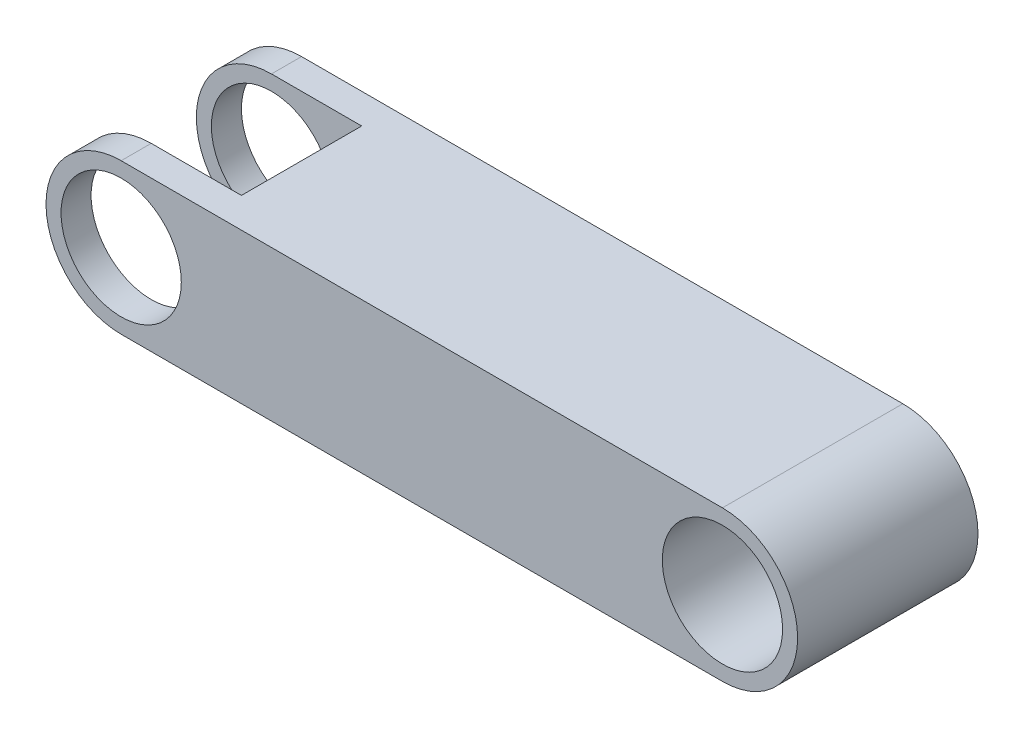
ISO-10303-21;
HEADER;
FILE_DESCRIPTION(('STEP AP214'),'2;1');
FILE_NAME('part.step','',(''),(''),'','','');
FILE_SCHEMA(('AUTOMOTIVE_DESIGN { 1 0 10303 214 1 1 1 1 }'));
ENDSEC;
DATA;
#1=APPLICATION_CONTEXT('core data for automotive mechanical design processes');
#2=APPLICATION_PROTOCOL_DEFINITION('international standard','automotive_design',2000,#1);
#3=PRODUCT_CONTEXT('',#1,'mechanical');
#4=PRODUCT('Part','Part','',(#3));
#5=PRODUCT_RELATED_PRODUCT_CATEGORY('part','',(#4));
#6=PRODUCT_DEFINITION_FORMATION('','',#4);
#7=PRODUCT_DEFINITION_CONTEXT('part definition',#1,'design');
#8=PRODUCT_DEFINITION('design','',#6,#7);
#9=PRODUCT_DEFINITION_SHAPE('','',#8);
#10=(LENGTH_UNIT() NAMED_UNIT(*) SI_UNIT(.MILLI.,.METRE.));
#11=(NAMED_UNIT(*) PLANE_ANGLE_UNIT() SI_UNIT($,.RADIAN.));
#12=(NAMED_UNIT(*) SI_UNIT($,.STERADIAN.) SOLID_ANGLE_UNIT());
#13=UNCERTAINTY_MEASURE_WITH_UNIT(LENGTH_MEASURE(1.E-05),#10,'distance_accuracy_value','');
#14=(GEOMETRIC_REPRESENTATION_CONTEXT(3) GLOBAL_UNCERTAINTY_ASSIGNED_CONTEXT((#13)) GLOBAL_UNIT_ASSIGNED_CONTEXT((#10,
#11,#12)) REPRESENTATION_CONTEXT('',''));
#15=CARTESIAN_POINT('',(0.,0.,0.));
#16=DIRECTION('',(0.,0.,1.));
#17=DIRECTION('',(1.,0.,0.));
#18=AXIS2_PLACEMENT_3D('',#15,#16,#17);
#19=CARTESIAN_POINT('',(0.,0.,15.));
#20=DIRECTION('',(0.,0.,-1.));
#21=DIRECTION('',(-1.,0.,0.));
#22=AXIS2_PLACEMENT_3D('',#19,#20,#21);
#23=CYLINDRICAL_SURFACE('',#22,12.5);
#24=DIRECTION('',(0.,0.,-1.));
#25=VECTOR('',#24,1.);
#26=CARTESIAN_POINT('',(0.,-12.5,15.));
#27=LINE('',#26,#25);
#28=CARTESIAN_POINT('',(0.,-12.5,-10.));
#29=VERTEX_POINT('',#28);
#30=CARTESIAN_POINT('',(0.,-12.5,-15.));
#31=VERTEX_POINT('',#30);
#32=EDGE_CURVE('E55',#29,#31,#27,.T.);
#33=ORIENTED_EDGE('',*,*,#32,.F.);
#34=CARTESIAN_POINT('',(0.,0.,-10.));
#35=DIRECTION('',(0.,0.,-1.));
#36=DIRECTION('',(-1.,0.,0.));
#37=AXIS2_PLACEMENT_3D('',#34,#35,#36);
#38=CIRCLE('',#37,12.5);
#39=CARTESIAN_POINT('',(0.,12.5,-10.));
#40=VERTEX_POINT('',#39);
#41=EDGE_CURVE('E156',#29,#40,#38,.T.);
#42=ORIENTED_EDGE('',*,*,#41,.T.);
#43=DIRECTION('',(0.,0.,-1.));
#44=VECTOR('',#43,1.);
#45=CARTESIAN_POINT('',(0.,12.5,15.));
#46=LINE('',#45,#44);
#47=CARTESIAN_POINT('',(0.,12.5,-15.));
#48=VERTEX_POINT('',#47);
#49=EDGE_CURVE('E94',#40,#48,#46,.T.);
#50=ORIENTED_EDGE('',*,*,#49,.T.);
#51=CARTESIAN_POINT('',(0.,0.,-15.));
#52=DIRECTION('',(0.,0.,1.));
#53=DIRECTION('',(1.,0.,0.));
#54=AXIS2_PLACEMENT_3D('',#51,#52,#53);
#55=CIRCLE('',#54,12.5);
#56=EDGE_CURVE('E172',#48,#31,#55,.T.);
#57=ORIENTED_EDGE('',*,*,#56,.T.);
#58=EDGE_LOOP('',(#33,#42,#50,#57));
#59=FACE_BOUND('',#58,.T.);
#60=ADVANCED_FACE('F45',(#59),#23,.T.);
#61=CARTESIAN_POINT('',(0.,0.,15.));
#62=DIRECTION('',(0.,0.,-1.));
#63=DIRECTION('',(-1.,0.,0.));
#64=AXIS2_PLACEMENT_3D('',#61,#62,#63);
#65=CYLINDRICAL_SURFACE('',#64,9.99999999999999);
#66=CARTESIAN_POINT('',(0.,0.,-10.));
#67=DIRECTION('',(0.,0.,-1.));
#68=DIRECTION('',(-1.,0.,0.));
#69=AXIS2_PLACEMENT_3D('',#66,#67,#68);
#70=CIRCLE('',#69,9.99999999999999);
#71=CARTESIAN_POINT('',(-9.99999999999999,0.,-10.));
#72=VERTEX_POINT('',#71);
#73=EDGE_CURVE('E49',#72,#72,#70,.T.);
#74=ORIENTED_EDGE('',*,*,#73,.F.);
#75=EDGE_LOOP('',(#74));
#76=FACE_BOUND('',#75,.T.);
#77=CARTESIAN_POINT('',(0.,0.,-15.));
#78=DIRECTION('',(0.,0.,1.));
#79=DIRECTION('',(1.,0.,0.));
#80=AXIS2_PLACEMENT_3D('',#77,#78,#79);
#81=CIRCLE('',#80,9.99999999999999);
#82=CARTESIAN_POINT('',(9.99999999999999,0.,-15.));
#83=VERTEX_POINT('',#82);
#84=EDGE_CURVE('E164',#83,#83,#81,.T.);
#85=ORIENTED_EDGE('',*,*,#84,.F.);
#86=EDGE_LOOP('',(#85));
#87=FACE_BOUND('',#86,.T.);
#88=ADVANCED_FACE('F242',(#76,#87),#65,.F.);
#89=CARTESIAN_POINT('',(0.,0.,15.));
#90=DIRECTION('',(0.,0.,1.));
#91=DIRECTION('',(1.,0.,0.));
#92=AXIS2_PLACEMENT_3D('',#89,#90,#91);
#93=PLANE('',#92);
#94=CARTESIAN_POINT('',(0.,0.,15.));
#95=DIRECTION('',(0.,0.,1.));
#96=DIRECTION('',(1.,0.,0.));
#97=AXIS2_PLACEMENT_3D('',#94,#95,#96);
#98=CIRCLE('',#97,9.99999999999999);
#99=CARTESIAN_POINT('',(9.99999999999999,0.,15.));
#100=VERTEX_POINT('',#99);
#101=EDGE_CURVE('E168',#100,#100,#98,.T.);
#102=ORIENTED_EDGE('',*,*,#101,.F.);
#103=EDGE_LOOP('',(#102));
#104=FACE_BOUND('',#103,.T.);
#105=CARTESIAN_POINT('',(0.,0.,15.));
#106=DIRECTION('',(0.,0.,1.));
#107=DIRECTION('',(1.,0.,0.));
#108=AXIS2_PLACEMENT_3D('',#105,#106,#107);
#109=CIRCLE('',#108,12.5);
#110=CARTESIAN_POINT('',(0.,12.5,15.));
#111=VERTEX_POINT('',#110);
#112=CARTESIAN_POINT('',(0.,-12.5,15.));
#113=VERTEX_POINT('',#112);
#114=EDGE_CURVE('E176',#111,#113,#109,.T.);
#115=ORIENTED_EDGE('',*,*,#114,.T.);
#116=DIRECTION('',(1.,0.,0.));
#117=VECTOR('',#116,1.);
#118=CARTESIAN_POINT('',(0.,-12.5,15.));
#119=LINE('',#118,#117);
#120=CARTESIAN_POINT('',(100.,-12.5,15.));
#121=VERTEX_POINT('',#120);
#122=EDGE_CURVE('E101',#113,#121,#119,.T.);
#123=ORIENTED_EDGE('',*,*,#122,.T.);
#124=CARTESIAN_POINT('',(100.,0.,15.));
#125=DIRECTION('',(0.,0.,1.));
#126=DIRECTION('',(1.,0.,0.));
#127=AXIS2_PLACEMENT_3D('',#124,#125,#126);
#128=CIRCLE('',#127,12.5);
#129=CARTESIAN_POINT('',(100.,12.5,15.));
#130=VERTEX_POINT('',#129);
#131=EDGE_CURVE('E182',#121,#130,#128,.T.);
#132=ORIENTED_EDGE('',*,*,#131,.T.);
#133=DIRECTION('',(-1.,0.,0.));
#134=VECTOR('',#133,1.);
#135=CARTESIAN_POINT('',(0.,12.5,15.));
#136=LINE('',#135,#134);
#137=EDGE_CURVE('E72',#130,#111,#136,.T.);
#138=ORIENTED_EDGE('',*,*,#137,.T.);
#139=EDGE_LOOP('',(#115,#123,#132,#138));
#140=FACE_BOUND('',#139,.T.);
#141=CARTESIAN_POINT('',(100.,0.,15.));
#142=DIRECTION('',(0.,0.,1.));
#143=DIRECTION('',(1.,0.,0.));
#144=AXIS2_PLACEMENT_3D('',#141,#142,#143);
#145=CIRCLE('',#144,9.99999999999999);
#146=CARTESIAN_POINT('',(110.,0.,15.));
#147=VERTEX_POINT('',#146);
#148=EDGE_CURVE('E160',#147,#147,#145,.T.);
#149=ORIENTED_EDGE('',*,*,#148,.F.);
#150=EDGE_LOOP('',(#149));
#151=FACE_BOUND('',#150,.T.);
#152=ADVANCED_FACE('F245',(#104,#140,#151),#93,.T.);
#153=CARTESIAN_POINT('',(0.,0.,-15.));
#154=DIRECTION('',(0.,0.,1.));
#155=DIRECTION('',(1.,0.,0.));
#156=AXIS2_PLACEMENT_3D('',#153,#154,#155);
#157=PLANE('',#156);
#158=ORIENTED_EDGE('',*,*,#56,.F.);
#159=DIRECTION('',(-1.,0.,0.));
#160=VECTOR('',#159,1.);
#161=CARTESIAN_POINT('',(0.,12.5,-15.));
#162=LINE('',#161,#160);
#163=CARTESIAN_POINT('',(100.,12.5,-15.));
#164=VERTEX_POINT('',#163);
#165=EDGE_CURVE('E179',#164,#48,#162,.T.);
#166=ORIENTED_EDGE('',*,*,#165,.F.);
#167=CARTESIAN_POINT('',(100.,0.,-15.));
#168=DIRECTION('',(0.,0.,1.));
#169=DIRECTION('',(1.,0.,0.));
#170=AXIS2_PLACEMENT_3D('',#167,#168,#169);
#171=CIRCLE('',#170,12.5);
#172=CARTESIAN_POINT('',(100.,-12.5,-15.));
#173=VERTEX_POINT('',#172);
#174=EDGE_CURVE('E192',#173,#164,#171,.T.);
#175=ORIENTED_EDGE('',*,*,#174,.F.);
#176=DIRECTION('',(1.,0.,0.));
#177=VECTOR('',#176,1.);
#178=CARTESIAN_POINT('',(0.,-12.5,-15.));
#179=LINE('',#178,#177);
#180=EDGE_CURVE('E189',#31,#173,#179,.T.);
#181=ORIENTED_EDGE('',*,*,#180,.F.);
#182=EDGE_LOOP('',(#158,#166,#175,#181));
#183=FACE_BOUND('',#182,.T.);
#184=ORIENTED_EDGE('',*,*,#84,.T.);
#185=EDGE_LOOP('',(#184));
#186=FACE_BOUND('',#185,.T.);
#187=CARTESIAN_POINT('',(100.,0.,-15.));
#188=DIRECTION('',(0.,0.,1.));
#189=DIRECTION('',(1.,0.,0.));
#190=AXIS2_PLACEMENT_3D('',#187,#188,#189);
#191=CIRCLE('',#190,9.99999999999999);
#192=CARTESIAN_POINT('',(110.,0.,-15.));
#193=VERTEX_POINT('',#192);
#194=EDGE_CURVE('E159',#193,#193,#191,.T.);
#195=ORIENTED_EDGE('',*,*,#194,.T.);
#196=EDGE_LOOP('',(#195));
#197=FACE_BOUND('',#196,.T.);
#198=ADVANCED_FACE('F231',(#183,#186,#197),#157,.F.);
#199=CARTESIAN_POINT('',(0.,12.5,10.));
#200=VERTEX_POINT('',#199);
#201=EDGE_CURVE('E197',#111,#200,#46,.T.);
#202=ORIENTED_EDGE('',*,*,#201,.T.);
#203=CARTESIAN_POINT('',(0.,0.,10.));
#204=DIRECTION('',(0.,0.,1.));
#205=DIRECTION('',(1.,0.,0.));
#206=AXIS2_PLACEMENT_3D('',#203,#204,#205);
#207=CIRCLE('',#206,12.5);
#208=CARTESIAN_POINT('',(0.,-12.5,10.));
#209=VERTEX_POINT('',#208);
#210=EDGE_CURVE('E151',#200,#209,#207,.T.);
#211=ORIENTED_EDGE('',*,*,#210,.T.);
#212=EDGE_CURVE('E11',#113,#209,#27,.T.);
#213=ORIENTED_EDGE('',*,*,#212,.F.);
#214=ORIENTED_EDGE('',*,*,#114,.F.);
#215=EDGE_LOOP('',(#202,#211,#213,#214));
#216=FACE_BOUND('',#215,.T.);
#217=ADVANCED_FACE('F47',(#216),#23,.T.);
#218=CARTESIAN_POINT('',(0.,-12.5,15.));
#219=DIRECTION('',(0.,1.,0.));
#220=DIRECTION('',(0.,0.,1.));
#221=AXIS2_PLACEMENT_3D('',#218,#219,#220);
#222=PLANE('',#221);
#223=DIRECTION('',(0.,0.,-1.));
#224=VECTOR('',#223,1.);
#225=CARTESIAN_POINT('',(15.,-12.5,10.));
#226=LINE('',#225,#224);
#227=CARTESIAN_POINT('',(15.,-12.5,10.));
#228=VERTEX_POINT('',#227);
#229=CARTESIAN_POINT('',(15.,-12.5,-10.));
#230=VERTEX_POINT('',#229);
#231=EDGE_CURVE('E142',#228,#230,#226,.T.);
#232=ORIENTED_EDGE('',*,*,#231,.T.);
#233=DIRECTION('',(1.,0.,0.));
#234=VECTOR('',#233,1.);
#235=CARTESIAN_POINT('',(-15.,-12.5,-10.));
#236=LINE('',#235,#234);
#237=EDGE_CURVE('E136',#29,#230,#236,.T.);
#238=ORIENTED_EDGE('',*,*,#237,.F.);
#239=ORIENTED_EDGE('',*,*,#32,.T.);
#240=ORIENTED_EDGE('',*,*,#180,.T.);
#241=DIRECTION('',(0.,0.,-1.));
#242=VECTOR('',#241,1.);
#243=CARTESIAN_POINT('',(100.,-12.5,15.));
#244=LINE('',#243,#242);
#245=EDGE_CURVE('E205',#121,#173,#244,.T.);
#246=ORIENTED_EDGE('',*,*,#245,.F.);
#247=ORIENTED_EDGE('',*,*,#122,.F.);
#248=ORIENTED_EDGE('',*,*,#212,.T.);
#249=DIRECTION('',(1.,0.,0.));
#250=VECTOR('',#249,1.);
#251=CARTESIAN_POINT('',(-15.,-12.5,10.));
#252=LINE('',#251,#250);
#253=EDGE_CURVE('E146',#209,#228,#252,.T.);
#254=ORIENTED_EDGE('',*,*,#253,.T.);
#255=EDGE_LOOP('',(#232,#238,#239,#240,#246,#247,#248,#254));
#256=FACE_BOUND('',#255,.T.);
#257=ADVANCED_FACE('F220',(#256),#222,.F.);
#258=CARTESIAN_POINT('',(100.,0.,15.));
#259=DIRECTION('',(0.,0.,-1.));
#260=DIRECTION('',(-1.,0.,0.));
#261=AXIS2_PLACEMENT_3D('',#258,#259,#260);
#262=CYLINDRICAL_SURFACE('',#261,12.5);
#263=ORIENTED_EDGE('',*,*,#174,.T.);
#264=DIRECTION('',(0.,0.,-1.));
#265=VECTOR('',#264,1.);
#266=CARTESIAN_POINT('',(100.,12.5,15.));
#267=LINE('',#266,#265);
#268=EDGE_CURVE('E201',#130,#164,#267,.T.);
#269=ORIENTED_EDGE('',*,*,#268,.F.);
#270=ORIENTED_EDGE('',*,*,#131,.F.);
#271=ORIENTED_EDGE('',*,*,#245,.T.);
#272=EDGE_LOOP('',(#263,#269,#270,#271));
#273=FACE_BOUND('',#272,.T.);
#274=ADVANCED_FACE('F272',(#273),#262,.T.);
#275=CARTESIAN_POINT('',(0.,12.5,15.));
#276=DIRECTION('',(0.,-1.,0.));
#277=DIRECTION('',(0.,0.,-1.));
#278=AXIS2_PLACEMENT_3D('',#275,#276,#277);
#279=PLANE('',#278);
#280=ORIENTED_EDGE('',*,*,#49,.F.);
#281=DIRECTION('',(1.,0.,0.));
#282=VECTOR('',#281,1.);
#283=CARTESIAN_POINT('',(-15.,12.5,-10.));
#284=LINE('',#283,#282);
#285=CARTESIAN_POINT('',(15.,12.5,-10.));
#286=VERTEX_POINT('',#285);
#287=EDGE_CURVE('E134',#40,#286,#284,.T.);
#288=ORIENTED_EDGE('',*,*,#287,.T.);
#289=DIRECTION('',(0.,0.,1.));
#290=VECTOR('',#289,1.);
#291=CARTESIAN_POINT('',(15.,12.5,10.));
#292=LINE('',#291,#290);
#293=CARTESIAN_POINT('',(15.,12.5,10.));
#294=VERTEX_POINT('',#293);
#295=EDGE_CURVE('E122',#286,#294,#292,.T.);
#296=ORIENTED_EDGE('',*,*,#295,.T.);
#297=DIRECTION('',(1.,0.,0.));
#298=VECTOR('',#297,1.);
#299=CARTESIAN_POINT('',(-15.,12.5,10.));
#300=LINE('',#299,#298);
#301=EDGE_CURVE('E141',#200,#294,#300,.T.);
#302=ORIENTED_EDGE('',*,*,#301,.F.);
#303=ORIENTED_EDGE('',*,*,#201,.F.);
#304=ORIENTED_EDGE('',*,*,#137,.F.);
#305=ORIENTED_EDGE('',*,*,#268,.T.);
#306=ORIENTED_EDGE('',*,*,#165,.T.);
#307=EDGE_LOOP('',(#280,#288,#296,#302,#303,#304,#305,#306));
#308=FACE_BOUND('',#307,.T.);
#309=ADVANCED_FACE('F139',(#308),#279,.F.);
#310=CARTESIAN_POINT('',(0.,0.,10.));
#311=DIRECTION('',(0.,0.,1.));
#312=DIRECTION('',(1.,0.,0.));
#313=AXIS2_PLACEMENT_3D('',#310,#311,#312);
#314=CIRCLE('',#313,9.99999999999999);
#315=CARTESIAN_POINT('',(9.99999999999999,0.,10.));
#316=VERTEX_POINT('',#315);
#317=EDGE_CURVE('E155',#316,#316,#314,.T.);
#318=ORIENTED_EDGE('',*,*,#317,.F.);
#319=EDGE_LOOP('',(#318));
#320=FACE_BOUND('',#319,.T.);
#321=ORIENTED_EDGE('',*,*,#101,.T.);
#322=EDGE_LOOP('',(#321));
#323=FACE_BOUND('',#322,.T.);
#324=ADVANCED_FACE('F247',(#320,#323),#65,.F.);
#325=CARTESIAN_POINT('',(100.,0.,15.));
#326=DIRECTION('',(0.,0.,-1.));
#327=DIRECTION('',(-1.,0.,0.));
#328=AXIS2_PLACEMENT_3D('',#325,#326,#327);
#329=CYLINDRICAL_SURFACE('',#328,9.99999999999999);
#330=ORIENTED_EDGE('',*,*,#148,.T.);
#331=EDGE_LOOP('',(#330));
#332=FACE_BOUND('',#331,.T.);
#333=ORIENTED_EDGE('',*,*,#194,.F.);
#334=EDGE_LOOP('',(#333));
#335=FACE_BOUND('',#334,.T.);
#336=ADVANCED_FACE('F254',(#332,#335),#329,.F.);
#337=CARTESIAN_POINT('',(-15.,-12.5,-10.));
#338=DIRECTION('',(0.,0.,-1.));
#339=DIRECTION('',(-1.,0.,0.));
#340=AXIS2_PLACEMENT_3D('',#337,#338,#339);
#341=PLANE('',#340);
#342=ORIENTED_EDGE('',*,*,#73,.T.);
#343=EDGE_LOOP('',(#342));
#344=FACE_BOUND('',#343,.T.);
#345=ORIENTED_EDGE('',*,*,#237,.T.);
#346=DIRECTION('',(0.,1.,0.));
#347=VECTOR('',#346,1.);
#348=CARTESIAN_POINT('',(15.,-12.5,-10.));
#349=LINE('',#348,#347);
#350=EDGE_CURVE('E125',#230,#286,#349,.T.);
#351=ORIENTED_EDGE('',*,*,#350,.T.);
#352=ORIENTED_EDGE('',*,*,#287,.F.);
#353=ORIENTED_EDGE('',*,*,#41,.F.);
#354=EDGE_LOOP('',(#345,#351,#352,#353));
#355=FACE_BOUND('',#354,.T.);
#356=ADVANCED_FACE('F133',(#344,#355),#341,.F.);
#357=CARTESIAN_POINT('',(-15.,-12.5,10.));
#358=DIRECTION('',(0.,0.,1.));
#359=DIRECTION('',(1.,0.,0.));
#360=AXIS2_PLACEMENT_3D('',#357,#358,#359);
#361=PLANE('',#360);
#362=ORIENTED_EDGE('',*,*,#317,.T.);
#363=EDGE_LOOP('',(#362));
#364=FACE_BOUND('',#363,.T.);
#365=ORIENTED_EDGE('',*,*,#301,.T.);
#366=DIRECTION('',(0.,-1.,0.));
#367=VECTOR('',#366,1.);
#368=CARTESIAN_POINT('',(15.,-12.5,10.));
#369=LINE('',#368,#367);
#370=EDGE_CURVE('E63',#294,#228,#369,.T.);
#371=ORIENTED_EDGE('',*,*,#370,.T.);
#372=ORIENTED_EDGE('',*,*,#253,.F.);
#373=ORIENTED_EDGE('',*,*,#210,.F.);
#374=EDGE_LOOP('',(#365,#371,#372,#373));
#375=FACE_BOUND('',#374,.T.);
#376=ADVANCED_FACE('F219',(#364,#375),#361,.F.);
#377=CARTESIAN_POINT('',(15.,0.,0.));
#378=DIRECTION('',(-1.,0.,0.));
#379=DIRECTION('',(0.,0.,1.));
#380=AXIS2_PLACEMENT_3D('',#377,#378,#379);
#381=PLANE('',#380);
#382=ORIENTED_EDGE('',*,*,#350,.F.);
#383=ORIENTED_EDGE('',*,*,#231,.F.);
#384=ORIENTED_EDGE('',*,*,#370,.F.);
#385=ORIENTED_EDGE('',*,*,#295,.F.);
#386=EDGE_LOOP('',(#382,#383,#384,#385));
#387=FACE_BOUND('',#386,.T.);
#388=ADVANCED_FACE('F124',(#387),#381,.T.);
#389=CLOSED_SHELL('',(#60,#88,#152,#198,#217,#257,#274,#309,#324,#336,#356,#376,#388));
#390=MANIFOLD_SOLID_BREP('B2',#389);
#391=ADVANCED_BREP_SHAPE_REPRESENTATION('',(#18,#390),#14);
#392=SHAPE_DEFINITION_REPRESENTATION(#9,#391);
ENDSEC;
END-ISO-10303-21;
